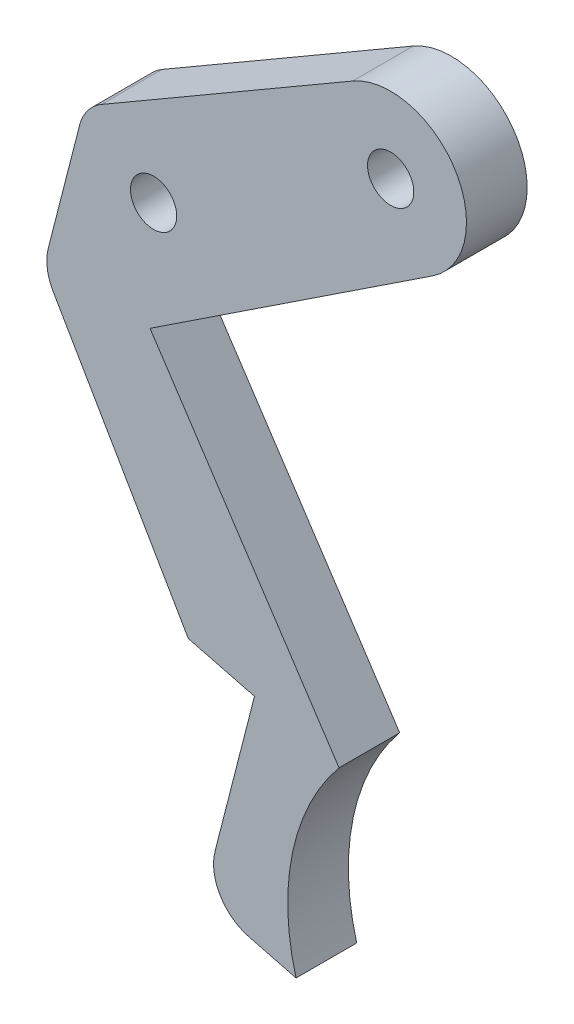
ISO-10303-21;
HEADER;
FILE_DESCRIPTION(('STEP AP214'),'2;1');
FILE_NAME('part.step','',(''),(''),'','','');
FILE_SCHEMA(('AUTOMOTIVE_DESIGN { 1 0 10303 214 1 1 1 1 }'));
ENDSEC;
DATA;
#1=APPLICATION_CONTEXT('core data for automotive mechanical design processes');
#2=APPLICATION_PROTOCOL_DEFINITION('international standard','automotive_design',2000,#1);
#3=PRODUCT_CONTEXT('',#1,'mechanical');
#4=PRODUCT('Part','Part','',(#3));
#5=PRODUCT_RELATED_PRODUCT_CATEGORY('part','',(#4));
#6=PRODUCT_DEFINITION_FORMATION('','',#4);
#7=PRODUCT_DEFINITION_CONTEXT('part definition',#1,'design');
#8=PRODUCT_DEFINITION('design','',#6,#7);
#9=PRODUCT_DEFINITION_SHAPE('','',#8);
#10=(LENGTH_UNIT() NAMED_UNIT(*) SI_UNIT(.MILLI.,.METRE.));
#11=(NAMED_UNIT(*) PLANE_ANGLE_UNIT() SI_UNIT($,.RADIAN.));
#12=(NAMED_UNIT(*) SI_UNIT($,.STERADIAN.) SOLID_ANGLE_UNIT());
#13=UNCERTAINTY_MEASURE_WITH_UNIT(LENGTH_MEASURE(1.E-05),#10,'distance_accuracy_value','');
#14=(GEOMETRIC_REPRESENTATION_CONTEXT(3) GLOBAL_UNCERTAINTY_ASSIGNED_CONTEXT((#13)) GLOBAL_UNIT_ASSIGNED_CONTEXT((#10,
#11,#12)) REPRESENTATION_CONTEXT('',''));
#15=CARTESIAN_POINT('',(0.,0.,0.));
#16=DIRECTION('',(0.,0.,1.));
#17=DIRECTION('',(1.,0.,0.));
#18=AXIS2_PLACEMENT_3D('',#15,#16,#17);
#19=CARTESIAN_POINT('',(-21.4657226807107,-112.416345350872,10.));
#20=DIRECTION('',(0.,0.,-1.));
#21=DIRECTION('',(-1.,0.,0.));
#22=AXIS2_PLACEMENT_3D('',#19,#20,#21);
#23=CYLINDRICAL_SURFACE('',#22,7.73301844287914);
#24=CARTESIAN_POINT('',(-21.4657226807107,-112.416345350872,0.));
#25=DIRECTION('',(0.,0.,1.));
#26=DIRECTION('',(-1.,0.,0.));
#27=AXIS2_PLACEMENT_3D('',#24,#25,#26);
#28=CIRCLE('',#27,7.73301844287914);
#29=CARTESIAN_POINT('',(-28.9564182217799,-110.495654186495,0.));
#30=VERTEX_POINT('',#29);
#31=CARTESIAN_POINT('',(-23.3864138450873,-119.907040891941,0.));
#32=VERTEX_POINT('',#31);
#33=EDGE_CURVE('E161',#30,#32,#28,.T.);
#34=ORIENTED_EDGE('',*,*,#33,.T.);
#35=DIRECTION('',(0.,0.,-1.));
#36=VECTOR('',#35,1.);
#37=CARTESIAN_POINT('',(-23.3864138450873,-119.907040891941,10.));
#38=LINE('',#37,#36);
#39=CARTESIAN_POINT('',(-23.3864138450873,-119.907040891941,10.));
#40=VERTEX_POINT('',#39);
#41=EDGE_CURVE('E11',#40,#32,#38,.T.);
#42=ORIENTED_EDGE('',*,*,#41,.F.);
#43=CARTESIAN_POINT('',(-21.4657226807107,-112.416345350872,10.));
#44=DIRECTION('',(0.,0.,1.));
#45=DIRECTION('',(-1.,0.,0.));
#46=AXIS2_PLACEMENT_3D('',#43,#44,#45);
#47=CIRCLE('',#46,7.73301844287914);
#48=CARTESIAN_POINT('',(-28.9564182217799,-110.495654186495,10.));
#49=VERTEX_POINT('',#48);
#50=EDGE_CURVE('E186',#49,#40,#47,.T.);
#51=ORIENTED_EDGE('',*,*,#50,.F.);
#52=DIRECTION('',(0.,0.,-1.));
#53=VECTOR('',#52,1.);
#54=CARTESIAN_POINT('',(-28.9564182217799,-110.495654186495,10.));
#55=LINE('',#54,#53);
#56=EDGE_CURVE('E157',#49,#30,#55,.T.);
#57=ORIENTED_EDGE('',*,*,#56,.T.);
#58=EDGE_LOOP('',(#34,#42,#51,#57));
#59=FACE_BOUND('',#58,.T.);
#60=ADVANCED_FACE('F33',(#59),#23,.T.);
#61=CARTESIAN_POINT('',(-15.596975427295,-121.904332793939,10.));
#62=DIRECTION('',(0.248375350267704,0.968663866044045,0.));
#63=DIRECTION('',(-0.968663866044045,0.248375350267704,0.));
#64=AXIS2_PLACEMENT_3D('',#61,#62,#63);
#65=PLANE('',#64);
#66=DIRECTION('',(0.968663866044045,-0.248375350267704,0.));
#67=VECTOR('',#66,1.);
#68=CARTESIAN_POINT('',(-15.596975427295,-121.904332793939,0.));
#69=LINE('',#68,#67);
#70=CARTESIAN_POINT('',(-15.596975427295,-121.904332793939,0.));
#71=VERTEX_POINT('',#70);
#72=EDGE_CURVE('E164',#32,#71,#69,.T.);
#73=ORIENTED_EDGE('',*,*,#72,.T.);
#74=DIRECTION('',(0.,0.,-1.));
#75=VECTOR('',#74,1.);
#76=CARTESIAN_POINT('',(-15.596975427295,-121.904332793939,10.));
#77=LINE('',#76,#75);
#78=CARTESIAN_POINT('',(-15.596975427295,-121.904332793939,10.));
#79=VERTEX_POINT('',#78);
#80=EDGE_CURVE('E42',#79,#71,#77,.T.);
#81=ORIENTED_EDGE('',*,*,#80,.F.);
#82=DIRECTION('',(0.968663866044045,-0.248375350267704,0.));
#83=VECTOR('',#82,1.);
#84=CARTESIAN_POINT('',(-15.596975427295,-121.904332793939,10.));
#85=LINE('',#84,#83);
#86=EDGE_CURVE('E109',#40,#79,#85,.T.);
#87=ORIENTED_EDGE('',*,*,#86,.F.);
#88=ORIENTED_EDGE('',*,*,#41,.T.);
#89=EDGE_LOOP('',(#73,#81,#87,#88));
#90=FACE_BOUND('',#89,.T.);
#91=ADVANCED_FACE('F269',(#90),#65,.F.);
#92=CARTESIAN_POINT('',(20.0110979626732,-111.901526353773,10.));
#93=DIRECTION('',(0.,0.,-1.));
#94=DIRECTION('',(-1.,0.,0.));
#95=AXIS2_PLACEMENT_3D('',#92,#93,#94);
#96=CYLINDRICAL_SURFACE('',#95,36.9863627195863);
#97=CARTESIAN_POINT('',(20.0110979626732,-111.901526353773,0.));
#98=DIRECTION('',(0.,0.,-1.));
#99=DIRECTION('',(-1.,0.,0.));
#100=AXIS2_PLACEMENT_3D('',#97,#98,#99);
#101=CIRCLE('',#100,36.9863627195863);
#102=CARTESIAN_POINT('',(-8.51160361076825,-88.3548382177056,0.));
#103=VERTEX_POINT('',#102);
#104=EDGE_CURVE('E167',#71,#103,#101,.T.);
#105=ORIENTED_EDGE('',*,*,#104,.T.);
#106=DIRECTION('',(0.,0.,-1.));
#107=VECTOR('',#106,1.);
#108=CARTESIAN_POINT('',(-8.51160361076825,-88.3548382177056,10.));
#109=LINE('',#108,#107);
#110=CARTESIAN_POINT('',(-8.51160361076825,-88.3548382177056,10.));
#111=VERTEX_POINT('',#110);
#112=EDGE_CURVE('E208',#111,#103,#109,.T.);
#113=ORIENTED_EDGE('',*,*,#112,.F.);
#114=CARTESIAN_POINT('',(20.0110979626732,-111.901526353773,10.));
#115=DIRECTION('',(0.,0.,-1.));
#116=DIRECTION('',(-1.,0.,0.));
#117=AXIS2_PLACEMENT_3D('',#114,#115,#116);
#118=CIRCLE('',#117,36.9863627195863);
#119=EDGE_CURVE('E227',#79,#111,#118,.T.);
#120=ORIENTED_EDGE('',*,*,#119,.F.);
#121=ORIENTED_EDGE('',*,*,#80,.T.);
#122=EDGE_LOOP('',(#105,#113,#120,#121));
#123=FACE_BOUND('',#122,.T.);
#124=ADVANCED_FACE('F273',(#123),#96,.F.);
#125=CARTESIAN_POINT('',(-39.6709795845273,-41.1902936962751,10.));
#126=DIRECTION('',(-0.834359016102985,-0.55122140038977,0.));
#127=DIRECTION('',(0.55122140038977,-0.834359016102985,0.));
#128=AXIS2_PLACEMENT_3D('',#125,#126,#127);
#129=PLANE('',#128);
#130=DIRECTION('',(-0.55122140038977,0.834359016102985,0.));
#131=VECTOR('',#130,1.);
#132=CARTESIAN_POINT('',(-39.6709795845273,-41.1902936962751,0.));
#133=LINE('',#132,#131);
#134=CARTESIAN_POINT('',(-39.6709795845273,-41.1902936962751,0.));
#135=VERTEX_POINT('',#134);
#136=EDGE_CURVE('E169',#103,#135,#133,.T.);
#137=ORIENTED_EDGE('',*,*,#136,.T.);
#138=DIRECTION('',(0.,0.,-1.));
#139=VECTOR('',#138,1.);
#140=CARTESIAN_POINT('',(-39.6709795845273,-41.1902936962751,10.));
#141=LINE('',#140,#139);
#142=CARTESIAN_POINT('',(-39.6709795845273,-41.1902936962751,10.));
#143=VERTEX_POINT('',#142);
#144=EDGE_CURVE('E205',#143,#135,#141,.T.);
#145=ORIENTED_EDGE('',*,*,#144,.F.);
#146=DIRECTION('',(-0.55122140038977,0.834359016102985,0.));
#147=VECTOR('',#146,1.);
#148=CARTESIAN_POINT('',(-39.6709795845273,-41.1902936962751,10.));
#149=LINE('',#148,#147);
#150=EDGE_CURVE('E229',#111,#143,#149,.T.);
#151=ORIENTED_EDGE('',*,*,#150,.F.);
#152=ORIENTED_EDGE('',*,*,#112,.T.);
#153=EDGE_LOOP('',(#137,#145,#151,#152));
#154=FACE_BOUND('',#153,.T.);
#155=ADVANCED_FACE('F277',(#154),#129,.F.);
#156=CARTESIAN_POINT('',(6.89026750487212,-10.4294877012873,10.));
#157=DIRECTION('',(-0.55122140038977,0.834359016102985,0.));
#158=DIRECTION('',(-0.834359016102985,-0.55122140038977,0.));
#159=AXIS2_PLACEMENT_3D('',#156,#157,#158);
#160=PLANE('',#159);
#161=DIRECTION('',(0.834359016102985,0.55122140038977,0.));
#162=VECTOR('',#161,1.);
#163=CARTESIAN_POINT('',(6.89026750487212,-10.4294877012873,0.));
#164=LINE('',#163,#162);
#165=CARTESIAN_POINT('',(6.89026750487212,-10.4294877012873,0.));
#166=VERTEX_POINT('',#165);
#167=EDGE_CURVE('E171',#135,#166,#164,.T.);
#168=ORIENTED_EDGE('',*,*,#167,.T.);
#169=DIRECTION('',(0.,0.,-1.));
#170=VECTOR('',#169,1.);
#171=CARTESIAN_POINT('',(6.89026750487212,-10.4294877012873,10.));
#172=LINE('',#171,#170);
#173=CARTESIAN_POINT('',(6.89026750487212,-10.4294877012873,10.));
#174=VERTEX_POINT('',#173);
#175=EDGE_CURVE('E202',#174,#166,#172,.T.);
#176=ORIENTED_EDGE('',*,*,#175,.F.);
#177=DIRECTION('',(0.834359016102985,0.55122140038977,0.));
#178=VECTOR('',#177,1.);
#179=CARTESIAN_POINT('',(6.89026750487212,-10.4294877012873,10.));
#180=LINE('',#179,#178);
#181=EDGE_CURVE('E231',#143,#174,#180,.T.);
#182=ORIENTED_EDGE('',*,*,#181,.F.);
#183=ORIENTED_EDGE('',*,*,#144,.T.);
#184=EDGE_LOOP('',(#168,#176,#182,#183));
#185=FACE_BOUND('',#184,.T.);
#186=ADVANCED_FACE('F283',(#185),#160,.F.);
#187=CARTESIAN_POINT('',(0.,0.,10.));
#188=DIRECTION('',(0.,0.,-1.));
#189=DIRECTION('',(-1.,0.,0.));
#190=AXIS2_PLACEMENT_3D('',#187,#188,#189);
#191=CYLINDRICAL_SURFACE('',#190,12.5);
#192=CARTESIAN_POINT('',(0.,0.,0.));
#193=DIRECTION('',(0.,0.,1.));
#194=DIRECTION('',(1.,0.,0.));
#195=AXIS2_PLACEMENT_3D('',#192,#193,#194);
#196=CIRCLE('',#195,12.5);
#197=CARTESIAN_POINT('',(-6.27703238764564,10.8096653234246,0.));
#198=VERTEX_POINT('',#197);
#199=EDGE_CURVE('E173',#166,#198,#196,.T.);
#200=ORIENTED_EDGE('',*,*,#199,.T.);
#201=DIRECTION('',(0.,0.,-1.));
#202=VECTOR('',#201,1.);
#203=CARTESIAN_POINT('',(-6.27703238764564,10.8096653234246,10.));
#204=LINE('',#203,#202);
#205=CARTESIAN_POINT('',(-6.27703238764564,10.8096653234246,10.));
#206=VERTEX_POINT('',#205);
#207=EDGE_CURVE('E199',#206,#198,#204,.T.);
#208=ORIENTED_EDGE('',*,*,#207,.F.);
#209=CARTESIAN_POINT('',(0.,0.,10.));
#210=DIRECTION('',(0.,0.,1.));
#211=DIRECTION('',(1.,0.,0.));
#212=AXIS2_PLACEMENT_3D('',#209,#210,#211);
#213=CIRCLE('',#212,12.5);
#214=EDGE_CURVE('E233',#174,#206,#213,.T.);
#215=ORIENTED_EDGE('',*,*,#214,.F.);
#216=ORIENTED_EDGE('',*,*,#175,.T.);
#217=EDGE_LOOP('',(#200,#208,#215,#216));
#218=FACE_BOUND('',#217,.T.);
#219=ADVANCED_FACE('F287',(#218),#191,.T.);
#220=CARTESIAN_POINT('',(-47.6724564598929,-13.2281202904137,10.));
#221=DIRECTION('',(0.502162591011651,-0.864773225873966,0.));
#222=DIRECTION('',(0.864773225873966,0.502162591011651,0.));
#223=AXIS2_PLACEMENT_3D('',#220,#221,#222);
#224=PLANE('',#223);
#225=DIRECTION('',(-0.864773225873966,-0.502162591011651,0.));
#226=VECTOR('',#225,1.);
#227=CARTESIAN_POINT('',(-47.6724564598929,-13.2281202904137,0.));
#228=LINE('',#227,#226);
#229=CARTESIAN_POINT('',(-47.6724564598929,-13.2281202904137,0.));
#230=VERTEX_POINT('',#229);
#231=EDGE_CURVE('E175',#198,#230,#228,.T.);
#232=ORIENTED_EDGE('',*,*,#231,.T.);
#233=DIRECTION('',(0.,0.,-1.));
#234=VECTOR('',#233,1.);
#235=CARTESIAN_POINT('',(-47.6724564598929,-13.2281202904137,10.));
#236=LINE('',#235,#234);
#237=CARTESIAN_POINT('',(-47.6724564598929,-13.2281202904137,10.));
#238=VERTEX_POINT('',#237);
#239=EDGE_CURVE('E196',#238,#230,#236,.T.);
#240=ORIENTED_EDGE('',*,*,#239,.F.);
#241=DIRECTION('',(-0.864773225873966,-0.502162591011651,0.));
#242=VECTOR('',#241,1.);
#243=CARTESIAN_POINT('',(-47.6724564598929,-13.2281202904137,10.));
#244=LINE('',#243,#242);
#245=EDGE_CURVE('E235',#206,#238,#244,.T.);
#246=ORIENTED_EDGE('',*,*,#245,.F.);
#247=ORIENTED_EDGE('',*,*,#207,.T.);
#248=EDGE_LOOP('',(#232,#240,#246,#247));
#249=FACE_BOUND('',#248,.T.);
#250=ADVANCED_FACE('F291',(#249),#224,.F.);
#251=CARTESIAN_POINT('',(-43.7892238822759,-19.9154275950052,10.));
#252=DIRECTION('',(0.,0.,-1.));
#253=DIRECTION('',(-1.,0.,0.));
#254=AXIS2_PLACEMENT_3D('',#251,#252,#253);
#255=CYLINDRICAL_SURFACE('',#254,7.73301844287915);
#256=CARTESIAN_POINT('',(-43.7892238822759,-19.9154275950052,0.));
#257=DIRECTION('',(0.,0.,1.));
#258=DIRECTION('',(1.,0.,0.));
#259=AXIS2_PLACEMENT_3D('',#256,#257,#258);
#260=CIRCLE('',#259,7.73301844287915);
#261=CARTESIAN_POINT('',(-51.2799194233451,-17.9947364306285,0.));
#262=VERTEX_POINT('',#261);
#263=EDGE_CURVE('E177',#230,#262,#260,.T.);
#264=ORIENTED_EDGE('',*,*,#263,.T.);
#265=DIRECTION('',(0.,0.,-1.));
#266=VECTOR('',#265,1.);
#267=CARTESIAN_POINT('',(-51.2799194233451,-17.9947364306285,10.));
#268=LINE('',#267,#266);
#269=CARTESIAN_POINT('',(-51.2799194233451,-17.9947364306285,10.));
#270=VERTEX_POINT('',#269);
#271=EDGE_CURVE('E193',#270,#262,#268,.T.);
#272=ORIENTED_EDGE('',*,*,#271,.F.);
#273=CARTESIAN_POINT('',(-43.7892238822759,-19.9154275950052,10.));
#274=DIRECTION('',(0.,0.,1.));
#275=DIRECTION('',(1.,0.,0.));
#276=AXIS2_PLACEMENT_3D('',#273,#274,#275);
#277=CIRCLE('',#276,7.73301844287915);
#278=EDGE_CURVE('E237',#238,#270,#277,.T.);
#279=ORIENTED_EDGE('',*,*,#278,.F.);
#280=ORIENTED_EDGE('',*,*,#239,.T.);
#281=EDGE_LOOP('',(#264,#272,#279,#280));
#282=FACE_BOUND('',#281,.T.);
#283=ADVANCED_FACE('F295',(#282),#255,.T.);
#284=CARTESIAN_POINT('',(-51.2799194233451,-17.9947364306285,10.));
#285=DIRECTION('',(0.968663866044045,-0.248375350267704,0.));
#286=DIRECTION('',(0.248375350267704,0.968663866044045,0.));
#287=AXIS2_PLACEMENT_3D('',#284,#285,#286);
#288=PLANE('',#287);
#289=DIRECTION('',(-0.248375350267704,-0.968663866044045,0.));
#290=VECTOR('',#289,1.);
#291=CARTESIAN_POINT('',(-51.2799194233451,-17.9947364306285,0.));
#292=LINE('',#291,#290);
#293=CARTESIAN_POINT('',(-56.4417061530948,-38.1257046766523,0.));
#294=VERTEX_POINT('',#293);
#295=EDGE_CURVE('E179',#262,#294,#292,.T.);
#296=ORIENTED_EDGE('',*,*,#295,.T.);
#297=DIRECTION('',(0.,0.,-1.));
#298=VECTOR('',#297,1.);
#299=CARTESIAN_POINT('',(-56.4417061530948,-38.1257046766523,10.));
#300=LINE('',#299,#298);
#301=CARTESIAN_POINT('',(-56.4417061530948,-38.1257046766523,10.));
#302=VERTEX_POINT('',#301);
#303=EDGE_CURVE('E190',#302,#294,#300,.T.);
#304=ORIENTED_EDGE('',*,*,#303,.F.);
#305=DIRECTION('',(-0.248375350267704,-0.968663866044045,0.));
#306=VECTOR('',#305,1.);
#307=CARTESIAN_POINT('',(-51.2799194233451,-17.9947364306285,10.));
#308=LINE('',#307,#306);
#309=EDGE_CURVE('E239',#270,#302,#308,.T.);
#310=ORIENTED_EDGE('',*,*,#309,.F.);
#311=ORIENTED_EDGE('',*,*,#271,.T.);
#312=EDGE_LOOP('',(#296,#304,#310,#311));
#313=FACE_BOUND('',#312,.T.);
#314=ADVANCED_FACE('F245',(#313),#288,.F.);
#315=CARTESIAN_POINT('',(-48.9510106120256,-40.046395841029,10.));
#316=DIRECTION('',(0.,0.,-1.));
#317=DIRECTION('',(-1.,0.,0.));
#318=AXIS2_PLACEMENT_3D('',#315,#316,#317);
#319=CYLINDRICAL_SURFACE('',#318,7.73301844287914);
#320=CARTESIAN_POINT('',(-48.9510106120256,-40.046395841029,0.));
#321=DIRECTION('',(0.,0.,1.));
#322=DIRECTION('',(1.,0.,0.));
#323=AXIS2_PLACEMENT_3D('',#320,#321,#322);
#324=CIRCLE('',#323,7.73301844287914);
#325=CARTESIAN_POINT('',(-55.6399255013023,-43.9268586796505,0.));
#326=VERTEX_POINT('',#325);
#327=EDGE_CURVE('E181',#294,#326,#324,.T.);
#328=ORIENTED_EDGE('',*,*,#327,.T.);
#329=DIRECTION('',(0.,0.,-1.));
#330=VECTOR('',#329,1.);
#331=CARTESIAN_POINT('',(-55.6399255013023,-43.9268586796505,10.));
#332=LINE('',#331,#330);
#333=CARTESIAN_POINT('',(-55.6399255013023,-43.9268586796505,10.));
#334=VERTEX_POINT('',#333);
#335=EDGE_CURVE('E152',#334,#326,#332,.T.);
#336=ORIENTED_EDGE('',*,*,#335,.F.);
#337=CARTESIAN_POINT('',(-48.9510106120256,-40.046395841029,10.));
#338=DIRECTION('',(0.,0.,1.));
#339=DIRECTION('',(1.,0.,0.));
#340=AXIS2_PLACEMENT_3D('',#337,#338,#339);
#341=CIRCLE('',#340,7.73301844287914);
#342=EDGE_CURVE('E143',#302,#334,#341,.T.);
#343=ORIENTED_EDGE('',*,*,#342,.F.);
#344=ORIENTED_EDGE('',*,*,#303,.T.);
#345=EDGE_LOOP('',(#328,#336,#343,#344));
#346=FACE_BOUND('',#345,.T.);
#347=ADVANCED_FACE('F249',(#346),#319,.T.);
#348=CARTESIAN_POINT('',(-55.6399255013023,-43.9268586796505,10.));
#349=DIRECTION('',(0.864981111668767,0.501804420522841,0.));
#350=DIRECTION('',(-0.501804420522841,0.864981111668767,0.));
#351=AXIS2_PLACEMENT_3D('',#348,#349,#350);
#352=PLANE('',#351);
#353=DIRECTION('',(0.501804420522841,-0.864981111668767,0.));
#354=VECTOR('',#353,1.);
#355=CARTESIAN_POINT('',(-55.6399255013023,-43.9268586796505,0.));
#356=LINE('',#355,#354);
#357=CARTESIAN_POINT('',(-33.3680690908785,-82.3177821727977,0.));
#358=VERTEX_POINT('',#357);
#359=EDGE_CURVE('E151',#326,#358,#356,.T.);
#360=ORIENTED_EDGE('',*,*,#359,.T.);
#361=DIRECTION('',(0.,0.,-1.));
#362=VECTOR('',#361,1.);
#363=CARTESIAN_POINT('',(-33.3680690908785,-82.3177821727977,10.));
#364=LINE('',#363,#362);
#365=CARTESIAN_POINT('',(-33.3680690908785,-82.3177821727977,10.));
#366=VERTEX_POINT('',#365);
#367=EDGE_CURVE('E148',#366,#358,#364,.T.);
#368=ORIENTED_EDGE('',*,*,#367,.F.);
#369=DIRECTION('',(0.501804420522841,-0.864981111668767,0.));
#370=VECTOR('',#369,1.);
#371=CARTESIAN_POINT('',(-55.6399255013023,-43.9268586796505,10.));
#372=LINE('',#371,#370);
#373=EDGE_CURVE('E137',#334,#366,#372,.T.);
#374=ORIENTED_EDGE('',*,*,#373,.F.);
#375=ORIENTED_EDGE('',*,*,#335,.T.);
#376=EDGE_LOOP('',(#360,#368,#374,#375));
#377=FACE_BOUND('',#376,.T.);
#378=ADVANCED_FACE('F149',(#377),#352,.F.);
#379=CARTESIAN_POINT('',(-33.3680690908785,-82.3177821727977,10.));
#380=DIRECTION('',(0.248375350267704,0.968663866044045,0.));
#381=DIRECTION('',(-0.968663866044045,0.248375350267704,0.));
#382=AXIS2_PLACEMENT_3D('',#379,#380,#381);
#383=PLANE('',#382);
#384=DIRECTION('',(0.968663866044045,-0.248375350267704,0.));
#385=VECTOR('',#384,1.);
#386=CARTESIAN_POINT('',(-33.3680690908785,-82.3177821727977,0.));
#387=LINE('',#386,#385);
#388=CARTESIAN_POINT('',(-22.4491973714207,-85.1174928700946,0.));
#389=VERTEX_POINT('',#388);
#390=EDGE_CURVE('E95',#358,#389,#387,.T.);
#391=ORIENTED_EDGE('',*,*,#390,.T.);
#392=DIRECTION('',(0.,0.,-1.));
#393=VECTOR('',#392,1.);
#394=CARTESIAN_POINT('',(-22.4491973714207,-85.1174928700946,10.));
#395=LINE('',#394,#393);
#396=CARTESIAN_POINT('',(-22.4491973714207,-85.1174928700946,10.));
#397=VERTEX_POINT('',#396);
#398=EDGE_CURVE('E153',#397,#389,#395,.T.);
#399=ORIENTED_EDGE('',*,*,#398,.F.);
#400=DIRECTION('',(0.968663866044045,-0.248375350267704,0.));
#401=VECTOR('',#400,1.);
#402=CARTESIAN_POINT('',(-33.3680690908785,-82.3177821727977,10.));
#403=LINE('',#402,#401);
#404=EDGE_CURVE('E141',#366,#397,#403,.T.);
#405=ORIENTED_EDGE('',*,*,#404,.F.);
#406=ORIENTED_EDGE('',*,*,#367,.T.);
#407=EDGE_LOOP('',(#391,#399,#405,#406));
#408=FACE_BOUND('',#407,.T.);
#409=ADVANCED_FACE('F155',(#408),#383,.F.);
#410=CARTESIAN_POINT('',(-28.9564182217799,-110.495654186495,10.));
#411=DIRECTION('',(0.968663866044045,-0.248375350267704,0.));
#412=DIRECTION('',(0.248375350267704,0.968663866044045,0.));
#413=AXIS2_PLACEMENT_3D('',#410,#411,#412);
#414=PLANE('',#413);
#415=DIRECTION('',(-0.248375350267704,-0.968663866044045,0.));
#416=VECTOR('',#415,1.);
#417=CARTESIAN_POINT('',(-28.9564182217799,-110.495654186495,0.));
#418=LINE('',#417,#416);
#419=EDGE_CURVE('E101',#389,#30,#418,.T.);
#420=ORIENTED_EDGE('',*,*,#419,.T.);
#421=ORIENTED_EDGE('',*,*,#56,.F.);
#422=DIRECTION('',(-0.248375350267704,-0.968663866044045,0.));
#423=VECTOR('',#422,1.);
#424=CARTESIAN_POINT('',(-28.9564182217799,-110.495654186495,10.));
#425=LINE('',#424,#423);
#426=EDGE_CURVE('E51',#397,#49,#425,.T.);
#427=ORIENTED_EDGE('',*,*,#426,.F.);
#428=ORIENTED_EDGE('',*,*,#398,.T.);
#429=EDGE_LOOP('',(#420,#421,#427,#428));
#430=FACE_BOUND('',#429,.T.);
#431=ADVANCED_FACE('F257',(#430),#414,.F.);
#432=CARTESIAN_POINT('',(-21.4657226807107,-112.416345350872,10.));
#433=DIRECTION('',(0.,0.,-1.));
#434=DIRECTION('',(-1.,0.,0.));
#435=AXIS2_PLACEMENT_3D('',#432,#433,#434);
#436=PLANE('',#435);
#437=CARTESIAN_POINT('',(-39.0801434854463,-22.9722726407166,9.99999999999999));
#438=DIRECTION('',(0.,0.,-1.));
#439=DIRECTION('',(-1.,0.,0.));
#440=AXIS2_PLACEMENT_3D('',#437,#438,#439);
#441=CIRCLE('',#440,3.81);
#442=CARTESIAN_POINT('',(-42.8901434854463,-22.9722726407166,9.99999999999999));
#443=VERTEX_POINT('',#442);
#444=EDGE_CURVE('E214',#443,#443,#441,.T.);
#445=ORIENTED_EDGE('',*,*,#444,.T.);
#446=EDGE_LOOP('',(#445));
#447=FACE_BOUND('',#446,.T.);
#448=CARTESIAN_POINT('',(0.,0.,9.99999999999999));
#449=DIRECTION('',(0.,0.,-1.));
#450=DIRECTION('',(-1.,0.,0.));
#451=AXIS2_PLACEMENT_3D('',#448,#449,#450);
#452=CIRCLE('',#451,3.81);
#453=CARTESIAN_POINT('',(-3.81,0.,9.99999999999999));
#454=VERTEX_POINT('',#453);
#455=EDGE_CURVE('E165',#454,#454,#452,.T.);
#456=ORIENTED_EDGE('',*,*,#455,.T.);
#457=EDGE_LOOP('',(#456));
#458=FACE_BOUND('',#457,.T.);
#459=ORIENTED_EDGE('',*,*,#50,.T.);
#460=ORIENTED_EDGE('',*,*,#86,.T.);
#461=ORIENTED_EDGE('',*,*,#119,.T.);
#462=ORIENTED_EDGE('',*,*,#150,.T.);
#463=ORIENTED_EDGE('',*,*,#181,.T.);
#464=ORIENTED_EDGE('',*,*,#214,.T.);
#465=ORIENTED_EDGE('',*,*,#245,.T.);
#466=ORIENTED_EDGE('',*,*,#278,.T.);
#467=ORIENTED_EDGE('',*,*,#309,.T.);
#468=ORIENTED_EDGE('',*,*,#342,.T.);
#469=ORIENTED_EDGE('',*,*,#373,.T.);
#470=ORIENTED_EDGE('',*,*,#404,.T.);
#471=ORIENTED_EDGE('',*,*,#426,.T.);
#472=EDGE_LOOP('',(#459,#460,#461,#462,#463,#464,#465,#466,#467,#468,#469,#470,#471));
#473=FACE_BOUND('',#472,.T.);
#474=ADVANCED_FACE('F139',(#447,#458,#473),#436,.F.);
#475=CARTESIAN_POINT('',(-21.4657226807107,-112.416345350872,0.));
#476=DIRECTION('',(0.,0.,-1.));
#477=DIRECTION('',(-1.,0.,0.));
#478=AXIS2_PLACEMENT_3D('',#475,#476,#477);
#479=PLANE('',#478);
#480=CARTESIAN_POINT('',(-39.0801434854463,-22.9722726407166,0.));
#481=DIRECTION('',(0.,0.,-1.));
#482=DIRECTION('',(-1.,0.,0.));
#483=AXIS2_PLACEMENT_3D('',#480,#481,#482);
#484=CIRCLE('',#483,3.81);
#485=CARTESIAN_POINT('',(-42.8901434854463,-22.9722726407166,0.));
#486=VERTEX_POINT('',#485);
#487=EDGE_CURVE('E36',#486,#486,#484,.T.);
#488=ORIENTED_EDGE('',*,*,#487,.F.);
#489=EDGE_LOOP('',(#488));
#490=FACE_BOUND('',#489,.T.);
#491=CARTESIAN_POINT('',(0.,0.,0.));
#492=DIRECTION('',(0.,0.,-1.));
#493=DIRECTION('',(-1.,0.,0.));
#494=AXIS2_PLACEMENT_3D('',#491,#492,#493);
#495=CIRCLE('',#494,3.81);
#496=CARTESIAN_POINT('',(-3.81,0.,0.));
#497=VERTEX_POINT('',#496);
#498=EDGE_CURVE('E212',#497,#497,#495,.T.);
#499=ORIENTED_EDGE('',*,*,#498,.F.);
#500=EDGE_LOOP('',(#499));
#501=FACE_BOUND('',#500,.T.);
#502=ORIENTED_EDGE('',*,*,#33,.F.);
#503=ORIENTED_EDGE('',*,*,#419,.F.);
#504=ORIENTED_EDGE('',*,*,#390,.F.);
#505=ORIENTED_EDGE('',*,*,#359,.F.);
#506=ORIENTED_EDGE('',*,*,#327,.F.);
#507=ORIENTED_EDGE('',*,*,#295,.F.);
#508=ORIENTED_EDGE('',*,*,#263,.F.);
#509=ORIENTED_EDGE('',*,*,#231,.F.);
#510=ORIENTED_EDGE('',*,*,#199,.F.);
#511=ORIENTED_EDGE('',*,*,#167,.F.);
#512=ORIENTED_EDGE('',*,*,#136,.F.);
#513=ORIENTED_EDGE('',*,*,#104,.F.);
#514=ORIENTED_EDGE('',*,*,#72,.F.);
#515=EDGE_LOOP('',(#502,#503,#504,#505,#506,#507,#508,#509,#510,#511,#512,#513,#514));
#516=FACE_BOUND('',#515,.T.);
#517=ADVANCED_FACE('F252',(#490,#501,#516),#479,.T.);
#518=CARTESIAN_POINT('',(0.,0.,-64.008));
#519=DIRECTION('',(0.,0.,1.));
#520=DIRECTION('',(1.,0.,0.));
#521=AXIS2_PLACEMENT_3D('',#518,#519,#520);
#522=CYLINDRICAL_SURFACE('',#521,3.81);
#523=ORIENTED_EDGE('',*,*,#498,.T.);
#524=EDGE_LOOP('',(#523));
#525=FACE_BOUND('',#524,.T.);
#526=ORIENTED_EDGE('',*,*,#455,.F.);
#527=EDGE_LOOP('',(#526));
#528=FACE_BOUND('',#527,.T.);
#529=ADVANCED_FACE('F328',(#525,#528),#522,.F.);
#530=CARTESIAN_POINT('',(-39.0801434854463,-22.9722726407166,-64.008));
#531=DIRECTION('',(0.,0.,1.));
#532=DIRECTION('',(1.,0.,0.));
#533=AXIS2_PLACEMENT_3D('',#530,#531,#532);
#534=CYLINDRICAL_SURFACE('',#533,3.81);
#535=ORIENTED_EDGE('',*,*,#487,.T.);
#536=EDGE_LOOP('',(#535));
#537=FACE_BOUND('',#536,.T.);
#538=ORIENTED_EDGE('',*,*,#444,.F.);
#539=EDGE_LOOP('',(#538));
#540=FACE_BOUND('',#539,.T.);
#541=ADVANCED_FACE('F336',(#537,#540),#534,.F.);
#542=CLOSED_SHELL('',(#60,#91,#124,#155,#186,#219,#250,#283,#314,#347,#378,#409,#431,#474,#517,
#529,#541));
#543=MANIFOLD_SOLID_BREP('B2',#542);
#544=ADVANCED_BREP_SHAPE_REPRESENTATION('',(#18,#543),#14);
#545=SHAPE_DEFINITION_REPRESENTATION(#9,#544);
ENDSEC;
END-ISO-10303-21;
